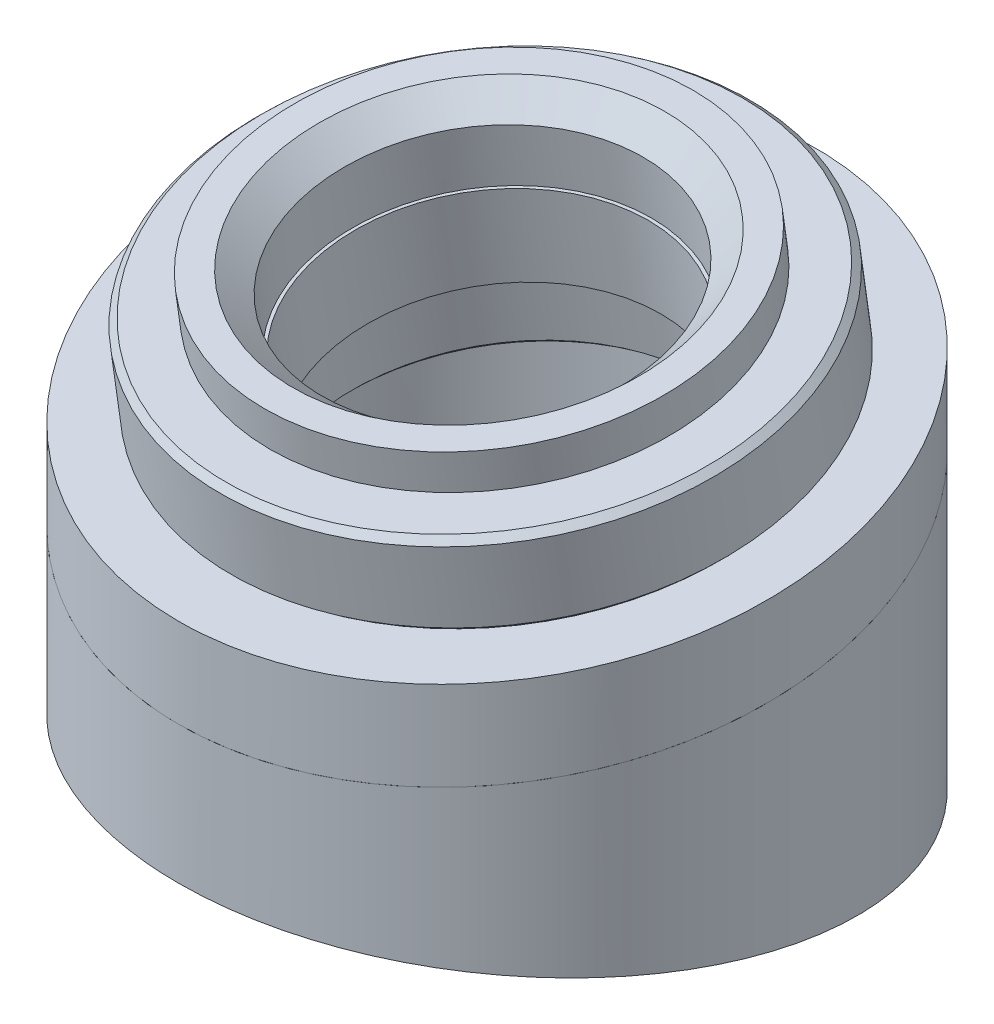
ISO-10303-21;
HEADER;
FILE_DESCRIPTION(('STEP AP214'),'2;1');
FILE_NAME('part.step','',(''),(''),'','','');
FILE_SCHEMA(('AUTOMOTIVE_DESIGN { 1 0 10303 214 1 1 1 1 }'));
ENDSEC;
DATA;
#1=APPLICATION_CONTEXT('core data for automotive mechanical design processes');
#2=APPLICATION_PROTOCOL_DEFINITION('international standard','automotive_design',2000,#1);
#3=PRODUCT_CONTEXT('',#1,'mechanical');
#4=PRODUCT('Part','Part','',(#3));
#5=PRODUCT_RELATED_PRODUCT_CATEGORY('part','',(#4));
#6=PRODUCT_DEFINITION_FORMATION('','',#4);
#7=PRODUCT_DEFINITION_CONTEXT('part definition',#1,'design');
#8=PRODUCT_DEFINITION('design','',#6,#7);
#9=PRODUCT_DEFINITION_SHAPE('','',#8);
#10=(LENGTH_UNIT() NAMED_UNIT(*) SI_UNIT(.MILLI.,.METRE.));
#11=(NAMED_UNIT(*) PLANE_ANGLE_UNIT() SI_UNIT($,.RADIAN.));
#12=(NAMED_UNIT(*) SI_UNIT($,.STERADIAN.) SOLID_ANGLE_UNIT());
#13=UNCERTAINTY_MEASURE_WITH_UNIT(LENGTH_MEASURE(1.E-05),#10,'distance_accuracy_value','');
#14=(GEOMETRIC_REPRESENTATION_CONTEXT(3) GLOBAL_UNCERTAINTY_ASSIGNED_CONTEXT((#13)) GLOBAL_UNIT_ASSIGNED_CONTEXT((#10,
#11,#12)) REPRESENTATION_CONTEXT('',''));
#15=CARTESIAN_POINT('',(0.,0.,0.));
#16=DIRECTION('',(0.,0.,1.));
#17=DIRECTION('',(1.,0.,0.));
#18=AXIS2_PLACEMENT_3D('',#15,#16,#17);
#19=CARTESIAN_POINT('',(4.08249158249159,-2.93246732801997,49.5120390170013));
#20=DIRECTION('',(0.,0.989821487042019,0.142314524170676));
#21=DIRECTION('',(-0.00188004141885013,-0.142314272661145,0.989819737750866));
#22=AXIS2_PLACEMENT_3D('',#19,#20,#21);
#23=PLANE('',#22);
#24=CARTESIAN_POINT('',(4.08249158249159,-2.93246732801997,49.5120390170013));
#25=DIRECTION('',(0.,0.989821487042019,0.142314524170676));
#26=DIRECTION('',(-0.00188004141885013,-0.142314272661145,0.989819737750866));
#27=AXIS2_PLACEMENT_3D('',#24,#25,#26);
#28=CIRCLE('',#27,15.5);
#29=CARTESIAN_POINT('',(4.05335094049941,-5.13833855426771,64.8542449521397));
#30=VERTEX_POINT('',#29);
#31=EDGE_CURVE('P0_E32',#30,#30,#28,.F.);
#32=ORIENTED_EDGE('',*,*,#31,.T.);
#33=EDGE_LOOP('',(#32));
#34=FACE_BOUND('',#33,.T.);
#35=CARTESIAN_POINT('',(4.08249158249159,-2.93246732801997,49.5120390170013));
#36=DIRECTION('',(0.,0.989821487042019,0.142314524170676));
#37=DIRECTION('',(-0.00188004141885013,-0.142314272661145,0.989819737750866));
#38=AXIS2_PLACEMENT_3D('',#35,#36,#37);
#39=CIRCLE('',#38,20.5);
#40=CARTESIAN_POINT('',(4.04395073340516,-5.84990991757343,69.8033436408941));
#41=VERTEX_POINT('',#40);
#42=EDGE_CURVE('P0_E37',#41,#41,#39,.T.);
#43=ORIENTED_EDGE('',*,*,#42,.T.);
#44=EDGE_LOOP('',(#43));
#45=FACE_BOUND('',#44,.T.);
#46=ADVANCED_FACE('P0_F16',(#34,#45),#23,.T.);
#47=CARTESIAN_POINT('',(4.08249158249159,-9.8612177373141,48.5158373478066));
#48=DIRECTION('',(0.,0.989821487042019,0.142314524170676));
#49=DIRECTION('',(-0.00188004141885013,-0.142314272661145,0.989819737750866));
#50=AXIS2_PLACEMENT_3D('',#47,#48,#49);
#51=PLANE('',#50);
#52=CARTESIAN_POINT('',(4.08249158249159,-9.8612177373141,48.5158373478066));
#53=DIRECTION('',(0.,0.989821487042019,0.142314524170676));
#54=DIRECTION('',(-0.00188004141885013,-0.142314272661145,0.989819737750866));
#55=AXIS2_PLACEMENT_3D('',#52,#53,#54);
#56=CIRCLE('',#55,15.5);
#57=CARTESIAN_POINT('',(4.05335094049941,-12.0670889635618,63.858043282945));
#58=VERTEX_POINT('',#57);
#59=EDGE_CURVE('P0_E49',#58,#58,#56,.T.);
#60=ORIENTED_EDGE('',*,*,#59,.T.);
#61=EDGE_LOOP('',(#60));
#62=FACE_BOUND('',#61,.T.);
#63=CARTESIAN_POINT('',(4.08249158249159,-9.8612177373141,48.5158373478066));
#64=DIRECTION('',(0.,0.989821487042019,0.142314524170676));
#65=DIRECTION('',(-0.00188004141885013,-0.142314272661145,0.989819737750866));
#66=AXIS2_PLACEMENT_3D('',#63,#64,#65);
#67=CIRCLE('',#66,20.5);
#68=CARTESIAN_POINT('',(4.04395073340516,-12.7786603268676,68.8071419716993));
#69=VERTEX_POINT('',#68);
#70=EDGE_CURVE('P0_E55',#69,#69,#67,.F.);
#71=ORIENTED_EDGE('',*,*,#70,.T.);
#72=EDGE_LOOP('',(#71));
#73=FACE_BOUND('',#72,.T.);
#74=ADVANCED_FACE('P0_F74',(#62,#73),#51,.F.);
#75=CARTESIAN_POINT('',(4.08249158249159,-2.93246732801997,49.5120390170013));
#76=DIRECTION('',(0.,-0.989821487042019,-0.142314524170676));
#77=DIRECTION('',(0.00188004141885013,0.142314272661145,-0.989819737750866));
#78=AXIS2_PLACEMENT_3D('',#75,#76,#77);
#79=CYLINDRICAL_SURFACE('',#78,21.);
#80=CARTESIAN_POINT('',(4.08249158249159,-9.36630699379309,48.5869946098919));
#81=DIRECTION('',(0.,0.989821487042019,0.142314524170676));
#82=DIRECTION('',(-0.00188004141885013,-0.142314272661145,0.989819737750866));
#83=AXIS2_PLACEMENT_3D('',#80,#81,#82);
#84=CIRCLE('',#83,21.);
#85=CARTESIAN_POINT('',(4.04301071269574,-12.3549067196771,69.3732091026601));
#86=VERTEX_POINT('',#85);
#87=EDGE_CURVE('P0_E11',#86,#86,#84,.T.);
#88=ORIENTED_EDGE('',*,*,#87,.T.);
#89=EDGE_LOOP('',(#88));
#90=FACE_BOUND('',#89,.T.);
#91=CARTESIAN_POINT('',(4.08249158249159,-3.42737807154099,49.4408817549159));
#92=DIRECTION('',(0.,0.989821487042019,0.142314524170676));
#93=DIRECTION('',(-0.00188004141885013,-0.142314272661145,0.989819737750866));
#94=AXIS2_PLACEMENT_3D('',#91,#92,#93);
#95=CIRCLE('',#94,21.);
#96=CARTESIAN_POINT('',(4.04301071269574,-6.41597779742503,70.2270962476841));
#97=VERTEX_POINT('',#96);
#98=EDGE_CURVE('P0_E26',#97,#97,#95,.F.);
#99=ORIENTED_EDGE('',*,*,#98,.T.);
#100=EDGE_LOOP('',(#99));
#101=FACE_BOUND('',#100,.T.);
#102=ADVANCED_FACE('P0_F77',(#90,#101),#79,.T.);
#103=CARTESIAN_POINT('',(4.08249158249159,-2.93246732801997,49.5120390170013));
#104=DIRECTION('',(0.,-0.989821487042019,-0.142314524170676));
#105=DIRECTION('',(0.00188004141885013,0.142314272661145,-0.989819737750866));
#106=AXIS2_PLACEMENT_3D('',#103,#104,#105);
#107=CYLINDRICAL_SURFACE('',#106,15.);
#108=CARTESIAN_POINT('',(4.08249158249159,-9.3663069937931,48.5869946098919));
#109=DIRECTION('',(0.,0.989821487042019,0.142314524170676));
#110=DIRECTION('',(-0.00188004141885013,-0.142314272661145,0.989819737750866));
#111=AXIS2_PLACEMENT_3D('',#108,#109,#110);
#112=CIRCLE('',#111,15.);
#113=CARTESIAN_POINT('',(4.05429096120884,-11.5010210837103,63.4342906761549));
#114=VERTEX_POINT('',#113);
#115=EDGE_CURVE('P0_E44',#114,#114,#112,.F.);
#116=ORIENTED_EDGE('',*,*,#115,.T.);
#117=EDGE_LOOP('',(#116));
#118=FACE_BOUND('',#117,.T.);
#119=CARTESIAN_POINT('',(4.08249158249159,-3.42737807154098,49.440881754916));
#120=DIRECTION('',(0.,0.989821487042019,0.142314524170676));
#121=DIRECTION('',(-0.00188004141885013,-0.142314272661145,0.989819737750866));
#122=AXIS2_PLACEMENT_3D('',#119,#120,#121);
#123=CIRCLE('',#122,15.);
#124=CARTESIAN_POINT('',(4.05429096120884,-5.56209216145815,64.2881778211789));
#125=VERTEX_POINT('',#124);
#126=EDGE_CURVE('P0_E54',#125,#125,#123,.T.);
#127=ORIENTED_EDGE('',*,*,#126,.T.);
#128=EDGE_LOOP('',(#127));
#129=FACE_BOUND('',#128,.T.);
#130=ADVANCED_FACE('P0_F65',(#118,#129),#107,.F.);
#131=CARTESIAN_POINT('',(4.08249158249159,-9.8612177373141,48.5158373478066));
#132=DIRECTION('',(0.,-0.989821487042019,-0.142314524170676));
#133=DIRECTION('',(0.00188004141885013,0.142314272661145,-0.989819737750866));
#134=AXIS2_PLACEMENT_3D('',#131,#132,#133);
#135=CONICAL_SURFACE('',#134,15.5,0.785398163397447);
#136=ORIENTED_EDGE('',*,*,#115,.F.);
#137=EDGE_LOOP('',(#136));
#138=FACE_BOUND('',#137,.T.);
#139=ORIENTED_EDGE('',*,*,#59,.F.);
#140=EDGE_LOOP('',(#139));
#141=FACE_BOUND('',#140,.T.);
#142=ADVANCED_FACE('P0_F67',(#138,#141),#135,.F.);
#143=CARTESIAN_POINT('',(4.08249158249159,-3.42737807154098,49.440881754916));
#144=DIRECTION('',(0.,0.989821487042019,0.142314524170676));
#145=DIRECTION('',(-0.00188004141885013,-0.142314272661145,0.989819737750866));
#146=AXIS2_PLACEMENT_3D('',#143,#144,#145);
#147=CONICAL_SURFACE('',#146,15.,0.785398163397452);
#148=ORIENTED_EDGE('',*,*,#31,.F.);
#149=EDGE_LOOP('',(#148));
#150=FACE_BOUND('',#149,.T.);
#151=ORIENTED_EDGE('',*,*,#126,.F.);
#152=EDGE_LOOP('',(#151));
#153=FACE_BOUND('',#152,.T.);
#154=ADVANCED_FACE('P0_F70',(#150,#153),#147,.F.);
#155=CARTESIAN_POINT('',(4.08249158249159,-9.36630699379309,48.5869946098919));
#156=DIRECTION('',(0.,0.989821487042019,0.142314524170676));
#157=DIRECTION('',(-0.00188004141885013,-0.142314272661145,0.989819737750866));
#158=AXIS2_PLACEMENT_3D('',#155,#156,#157);
#159=CONICAL_SURFACE('',#158,21.,0.785398163397448);
#160=ORIENTED_EDGE('',*,*,#70,.F.);
#161=EDGE_LOOP('',(#160));
#162=FACE_BOUND('',#161,.T.);
#163=ORIENTED_EDGE('',*,*,#87,.F.);
#164=EDGE_LOOP('',(#163));
#165=FACE_BOUND('',#164,.T.);
#166=ADVANCED_FACE('P0_F85',(#162,#165),#159,.T.);
#167=CARTESIAN_POINT('',(4.08249158249159,-2.93246732801997,49.5120390170013));
#168=DIRECTION('',(0.,-0.989821487042019,-0.142314524170676));
#169=DIRECTION('',(0.00188004141885013,0.142314272661145,-0.989819737750866));
#170=AXIS2_PLACEMENT_3D('',#167,#168,#169);
#171=CONICAL_SURFACE('',#170,20.5,0.785398163397441);
#172=ORIENTED_EDGE('',*,*,#98,.F.);
#173=EDGE_LOOP('',(#172));
#174=FACE_BOUND('',#173,.T.);
#175=ORIENTED_EDGE('',*,*,#42,.F.);
#176=EDGE_LOOP('',(#175));
#177=FACE_BOUND('',#176,.T.);
#178=ADVANCED_FACE('P0_F19',(#174,#177),#171,.T.);
#179=CLOSED_SHELL('',(#46,#74,#102,#130,#142,#154,#166,#178));
#180=MANIFOLD_SOLID_BREP('P0_B1',#179);
#181=CARTESIAN_POINT('',(4.0824915824906,-17.6104066475438,49.0075580002511));
#182=DIRECTION('',(0.,0.98982148704202,-0.142314524170668));
#183=DIRECTION('',(-0.603571987724496,0.11346858081768,0.789193092216045));
#184=AXIS2_PLACEMENT_3D('',#181,#182,#183);
#185=PLANE('',#184);
#186=CARTESIAN_POINT('',(4.0824915824906,-17.6104066475438,49.0075580002511));
#187=DIRECTION('',(0.,0.98982148704202,-0.142314524170668));
#188=DIRECTION('',(-0.603571987724496,0.11346858081768,0.789193092216045));
#189=AXIS2_PLACEMENT_3D('',#186,#187,#188);
#190=CIRCLE('',#189,15.5);
#191=CARTESIAN_POINT('',(-5.27287422723908,-15.8516436448697,61.2400509295998));
#192=VERTEX_POINT('',#191);
#193=EDGE_CURVE('P1_E33',#192,#192,#190,.F.);
#194=ORIENTED_EDGE('',*,*,#193,.T.);
#195=EDGE_LOOP('',(#194));
#196=FACE_BOUND('',#195,.T.);
#197=CARTESIAN_POINT('',(4.0824915824906,-17.6104066475438,49.0075580002511));
#198=DIRECTION('',(0.,0.98982148704202,-0.142314524170668));
#199=DIRECTION('',(-0.603571987724496,0.11346858081768,0.789193092216045));
#200=AXIS2_PLACEMENT_3D('',#197,#198,#199);
#201=CIRCLE('',#200,20.5);
#202=CARTESIAN_POINT('',(-8.29073416586156,-15.2843007407813,65.1860163906801));
#203=VERTEX_POINT('',#202);
#204=EDGE_CURVE('P1_E38',#203,#203,#201,.T.);
#205=ORIENTED_EDGE('',*,*,#204,.T.);
#206=EDGE_LOOP('',(#205));
#207=FACE_BOUND('',#206,.T.);
#208=ADVANCED_FACE('P1_F17',(#196,#207),#185,.T.);
#209=CARTESIAN_POINT('',(4.08249158249061,-24.5391570568379,50.0037596694458));
#210=DIRECTION('',(0.,0.98982148704202,-0.142314524170668));
#211=DIRECTION('',(-0.603571987724496,0.11346858081768,0.789193092216045));
#212=AXIS2_PLACEMENT_3D('',#209,#210,#211);
#213=PLANE('',#212);
#214=CARTESIAN_POINT('',(4.08249158249061,-24.5391570568379,50.0037596694458));
#215=DIRECTION('',(0.,0.98982148704202,-0.142314524170668));
#216=DIRECTION('',(-0.603571987724496,0.11346858081768,0.789193092216045));
#217=AXIS2_PLACEMENT_3D('',#214,#215,#216);
#218=CIRCLE('',#217,15.5);
#219=CARTESIAN_POINT('',(-5.27287422723907,-22.7803940541639,62.2362525987945));
#220=VERTEX_POINT('',#219);
#221=EDGE_CURVE('P1_E54',#220,#220,#218,.T.);
#222=ORIENTED_EDGE('',*,*,#221,.T.);
#223=EDGE_LOOP('',(#222));
#224=FACE_BOUND('',#223,.T.);
#225=CARTESIAN_POINT('',(4.08249158249061,-24.5391570568379,50.0037596694458));
#226=DIRECTION('',(0.,0.98982148704202,-0.142314524170668));
#227=DIRECTION('',(-0.603571987724496,0.11346858081768,0.789193092216045));
#228=AXIS2_PLACEMENT_3D('',#225,#226,#227);
#229=CIRCLE('',#228,20.5);
#230=CARTESIAN_POINT('',(-8.29073416586155,-22.2130511500755,66.1822180598747));
#231=VERTEX_POINT('',#230);
#232=EDGE_CURVE('P1_E59',#231,#231,#229,.F.);
#233=ORIENTED_EDGE('',*,*,#232,.T.);
#234=EDGE_LOOP('',(#233));
#235=FACE_BOUND('',#234,.T.);
#236=ADVANCED_FACE('P1_F64',(#224,#235),#213,.F.);
#237=CARTESIAN_POINT('',(4.0824915824906,-17.6104066475438,49.0075580002511));
#238=DIRECTION('',(0.,-0.98982148704202,0.142314524170668));
#239=DIRECTION('',(0.603571987724496,-0.11346858081768,-0.789193092216045));
#240=AXIS2_PLACEMENT_3D('',#237,#238,#239);
#241=CYLINDRICAL_SURFACE('',#240,21.);
#242=CARTESIAN_POINT('',(4.08249158249061,-24.0442463133169,49.9326024073605));
#243=DIRECTION('',(0.,0.98982148704202,-0.142314524170668));
#244=DIRECTION('',(-0.603571987724496,0.11346858081768,0.789193092216045));
#245=AXIS2_PLACEMENT_3D('',#242,#243,#244);
#246=CIRCLE('',#245,21.);
#247=CARTESIAN_POINT('',(-8.5925201597238,-21.6614061161456,66.5056573438974));
#248=VERTEX_POINT('',#247);
#249=EDGE_CURVE('P1_E11',#248,#248,#246,.T.);
#250=ORIENTED_EDGE('',*,*,#249,.T.);
#251=EDGE_LOOP('',(#250));
#252=FACE_BOUND('',#251,.T.);
#253=CARTESIAN_POINT('',(4.08249158249061,-18.1053173910648,49.0787152623365));
#254=DIRECTION('',(0.,0.98982148704202,-0.142314524170668));
#255=DIRECTION('',(-0.603571987724496,0.11346858081768,0.789193092216045));
#256=AXIS2_PLACEMENT_3D('',#253,#254,#255);
#257=CIRCLE('',#256,21.);
#258=CARTESIAN_POINT('',(-8.59252015972381,-15.7224771938935,65.6517701988734));
#259=VERTEX_POINT('',#258);
#260=EDGE_CURVE('P1_E27',#259,#259,#257,.F.);
#261=ORIENTED_EDGE('',*,*,#260,.T.);
#262=EDGE_LOOP('',(#261));
#263=FACE_BOUND('',#262,.T.);
#264=ADVANCED_FACE('P1_F84',(#252,#263),#241,.T.);
#265=CARTESIAN_POINT('',(4.0824915824906,-17.6104066475438,49.0075580002511));
#266=DIRECTION('',(0.,-0.98982148704202,0.142314524170668));
#267=DIRECTION('',(0.603571987724496,-0.11346858081768,-0.789193092216045));
#268=AXIS2_PLACEMENT_3D('',#265,#266,#267);
#269=CYLINDRICAL_SURFACE('',#268,15.);
#270=CARTESIAN_POINT('',(4.08249158249061,-24.0442463133169,49.9326024073605));
#271=DIRECTION('',(0.,0.98982148704202,-0.142314524170668));
#272=DIRECTION('',(-0.603571987724496,0.11346858081768,0.789193092216045));
#273=AXIS2_PLACEMENT_3D('',#270,#271,#272);
#274=CIRCLE('',#273,15.);
#275=CARTESIAN_POINT('',(-4.97108823337682,-22.3422176010517,61.7704987906012));
#276=VERTEX_POINT('',#275);
#277=EDGE_CURVE('P1_E45',#276,#276,#274,.F.);
#278=ORIENTED_EDGE('',*,*,#277,.T.);
#279=EDGE_LOOP('',(#278));
#280=FACE_BOUND('',#279,.T.);
#281=CARTESIAN_POINT('',(4.08249158249061,-18.1053173910648,49.0787152623365));
#282=DIRECTION('',(0.,0.98982148704202,-0.142314524170668));
#283=DIRECTION('',(-0.603571987724496,0.11346858081768,0.789193092216045));
#284=AXIS2_PLACEMENT_3D('',#281,#282,#283);
#285=CIRCLE('',#284,15.);
#286=CARTESIAN_POINT('',(-4.97108823337683,-16.4032886787996,60.9166116455771));
#287=VERTEX_POINT('',#286);
#288=EDGE_CURVE('P1_E50',#287,#287,#285,.T.);
#289=ORIENTED_EDGE('',*,*,#288,.T.);
#290=EDGE_LOOP('',(#289));
#291=FACE_BOUND('',#290,.T.);
#292=ADVANCED_FACE('P1_F89',(#280,#291),#269,.F.);
#293=CARTESIAN_POINT('',(4.08249158249061,-24.5391570568379,50.0037596694458));
#294=DIRECTION('',(0.,-0.98982148704202,0.142314524170668));
#295=DIRECTION('',(0.603571987724496,-0.11346858081768,-0.789193092216045));
#296=AXIS2_PLACEMENT_3D('',#293,#294,#295);
#297=CONICAL_SURFACE('',#296,15.5,0.785398163397447);
#298=ORIENTED_EDGE('',*,*,#277,.F.);
#299=EDGE_LOOP('',(#298));
#300=FACE_BOUND('',#299,.T.);
#301=ORIENTED_EDGE('',*,*,#221,.F.);
#302=EDGE_LOOP('',(#301));
#303=FACE_BOUND('',#302,.T.);
#304=ADVANCED_FACE('P1_F75',(#300,#303),#297,.F.);
#305=CARTESIAN_POINT('',(4.08249158249061,-18.1053173910648,49.0787152623365));
#306=DIRECTION('',(0.,0.98982148704202,-0.142314524170668));
#307=DIRECTION('',(-0.603571987724496,0.11346858081768,0.789193092216045));
#308=AXIS2_PLACEMENT_3D('',#305,#306,#307);
#309=CONICAL_SURFACE('',#308,15.,0.785398163397452);
#310=ORIENTED_EDGE('',*,*,#193,.F.);
#311=EDGE_LOOP('',(#310));
#312=FACE_BOUND('',#311,.T.);
#313=ORIENTED_EDGE('',*,*,#288,.F.);
#314=EDGE_LOOP('',(#313));
#315=FACE_BOUND('',#314,.T.);
#316=ADVANCED_FACE('P1_F69',(#312,#315),#309,.F.);
#317=CARTESIAN_POINT('',(4.08249158249061,-24.0442463133169,49.9326024073605));
#318=DIRECTION('',(0.,0.98982148704202,-0.142314524170668));
#319=DIRECTION('',(-0.603571987724496,0.11346858081768,0.789193092216045));
#320=AXIS2_PLACEMENT_3D('',#317,#318,#319);
#321=CONICAL_SURFACE('',#320,21.,0.785398163397448);
#322=ORIENTED_EDGE('',*,*,#232,.F.);
#323=EDGE_LOOP('',(#322));
#324=FACE_BOUND('',#323,.T.);
#325=ORIENTED_EDGE('',*,*,#249,.F.);
#326=EDGE_LOOP('',(#325));
#327=FACE_BOUND('',#326,.T.);
#328=ADVANCED_FACE('P1_F66',(#324,#327),#321,.T.);
#329=CARTESIAN_POINT('',(4.0824915824906,-17.6104066475438,49.0075580002511));
#330=DIRECTION('',(0.,-0.98982148704202,0.142314524170668));
#331=DIRECTION('',(0.603571987724496,-0.11346858081768,-0.789193092216045));
#332=AXIS2_PLACEMENT_3D('',#329,#330,#331);
#333=CONICAL_SURFACE('',#332,20.5,0.785398163397441);
#334=ORIENTED_EDGE('',*,*,#260,.F.);
#335=EDGE_LOOP('',(#334));
#336=FACE_BOUND('',#335,.T.);
#337=ORIENTED_EDGE('',*,*,#204,.F.);
#338=EDGE_LOOP('',(#337));
#339=FACE_BOUND('',#338,.T.);
#340=ADVANCED_FACE('P1_F20',(#336,#339),#333,.T.);
#341=CLOSED_SHELL('',(#208,#236,#264,#292,#304,#316,#328,#340));
#342=MANIFOLD_SOLID_BREP('P1_B1',#341);
#343=CARTESIAN_POINT('',(4.08249158249158,7.39013391009765,50.9962016691947));
#344=DIRECTION('',(0.,0.989821487042019,0.142314524170676));
#345=DIRECTION('',(-0.623827924002348,-0.111227584206739,0.773606583313801));
#346=AXIS2_PLACEMENT_3D('',#343,#344,#345);
#347=PLANE('',#346);
#348=CARTESIAN_POINT('',(4.08249158249158,7.39013391009765,50.9962016691947));
#349=DIRECTION('',(0.,0.989821487042019,0.142314524170676));
#350=DIRECTION('',(-0.623827924002348,-0.111227584206739,0.773606583313801));
#351=AXIS2_PLACEMENT_3D('',#348,#349,#350);
#352=CIRCLE('',#351,15.5);
#353=CARTESIAN_POINT('',(-5.58684123954483,5.66610635489319,62.9871037105587));
#354=VERTEX_POINT('',#353);
#355=EDGE_CURVE('P2_E33',#354,#354,#352,.F.);
#356=ORIENTED_EDGE('',*,*,#355,.T.);
#357=EDGE_LOOP('',(#356));
#358=FACE_BOUND('',#357,.T.);
#359=CARTESIAN_POINT('',(4.08249158249158,7.39013391009765,50.9962016691947));
#360=DIRECTION('',(0.,0.989821487042019,0.142314524170676));
#361=DIRECTION('',(-0.623827924002348,-0.111227584206739,0.773606583313801));
#362=AXIS2_PLACEMENT_3D('',#359,#360,#361);
#363=CIRCLE('',#362,20.5);
#364=CARTESIAN_POINT('',(-8.70598085955656,5.1099684338595,66.8551366271277));
#365=VERTEX_POINT('',#364);
#366=EDGE_CURVE('P2_E38',#365,#365,#363,.T.);
#367=ORIENTED_EDGE('',*,*,#366,.T.);
#368=EDGE_LOOP('',(#367));
#369=FACE_BOUND('',#368,.T.);
#370=ADVANCED_FACE('P2_F17',(#358,#369),#347,.T.);
#371=CARTESIAN_POINT('',(4.08249158249158,0.461383500803518,50.));
#372=DIRECTION('',(0.,0.989821487042019,0.142314524170676));
#373=DIRECTION('',(-0.623827924002348,-0.111227584206739,0.773606583313801));
#374=AXIS2_PLACEMENT_3D('',#371,#372,#373);
#375=PLANE('',#374);
#376=CARTESIAN_POINT('',(4.08249158249158,0.461383500803518,50.));
#377=DIRECTION('',(0.,0.989821487042019,0.142314524170676));
#378=DIRECTION('',(-0.623827924002348,-0.111227584206739,0.773606583313801));
#379=AXIS2_PLACEMENT_3D('',#376,#377,#378);
#380=CIRCLE('',#379,15.5);
#381=CARTESIAN_POINT('',(-5.58684123954482,-1.26264405440094,61.9909020413639));
#382=VERTEX_POINT('',#381);
#383=EDGE_CURVE('P2_E50',#382,#382,#380,.T.);
#384=ORIENTED_EDGE('',*,*,#383,.T.);
#385=EDGE_LOOP('',(#384));
#386=FACE_BOUND('',#385,.T.);
#387=CARTESIAN_POINT('',(4.08249158249158,0.461383500803518,50.));
#388=DIRECTION('',(0.,0.989821487042019,0.142314524170676));
#389=DIRECTION('',(-0.623827924002348,-0.111227584206739,0.773606583313801));
#390=AXIS2_PLACEMENT_3D('',#387,#388,#389);
#391=CIRCLE('',#390,20.5);
#392=CARTESIAN_POINT('',(-8.70598085955657,-1.81878197543464,65.8589349579329));
#393=VERTEX_POINT('',#392);
#394=EDGE_CURVE('P2_E56',#393,#393,#391,.F.);
#395=ORIENTED_EDGE('',*,*,#394,.T.);
#396=EDGE_LOOP('',(#395));
#397=FACE_BOUND('',#396,.T.);
#398=ADVANCED_FACE('P2_F75',(#386,#397),#375,.F.);
#399=CARTESIAN_POINT('',(4.08249158249158,7.39013391009765,50.9962016691947));
#400=DIRECTION('',(0.,-0.989821487042019,-0.142314524170676));
#401=DIRECTION('',(0.623827924002348,0.111227584206739,-0.773606583313801));
#402=AXIS2_PLACEMENT_3D('',#399,#400,#401);
#403=CYLINDRICAL_SURFACE('',#402,21.);
#404=CARTESIAN_POINT('',(4.08249158249158,0.956294244324528,50.0711572620853));
#405=DIRECTION('',(0.,0.989821487042019,0.142314524170676));
#406=DIRECTION('',(-0.623827924002348,-0.111227584206739,0.773606583313801));
#407=AXIS2_PLACEMENT_3D('',#404,#405,#406);
#408=CIRCLE('',#407,21.);
#409=CARTESIAN_POINT('',(-9.01789482155774,-1.37948502401699,66.3168955116752));
#410=VERTEX_POINT('',#409);
#411=EDGE_CURVE('P2_E11',#410,#410,#408,.T.);
#412=ORIENTED_EDGE('',*,*,#411,.T.);
#413=EDGE_LOOP('',(#412));
#414=FACE_BOUND('',#413,.T.);
#415=CARTESIAN_POINT('',(4.08249158249158,6.89522316657663,50.9250444071094));
#416=DIRECTION('',(0.,0.989821487042019,0.142314524170676));
#417=DIRECTION('',(-0.623827924002348,-0.111227584206739,0.773606583313801));
#418=AXIS2_PLACEMENT_3D('',#415,#416,#417);
#419=CIRCLE('',#418,21.);
#420=CARTESIAN_POINT('',(-9.01789482155774,4.55944389823511,67.1707826566992));
#421=VERTEX_POINT('',#420);
#422=EDGE_CURVE('P2_E27',#421,#421,#419,.F.);
#423=ORIENTED_EDGE('',*,*,#422,.T.);
#424=EDGE_LOOP('',(#423));
#425=FACE_BOUND('',#424,.T.);
#426=ADVANCED_FACE('P2_F78',(#414,#425),#403,.T.);
#427=CARTESIAN_POINT('',(4.08249158249158,7.39013391009765,50.9962016691947));
#428=DIRECTION('',(0.,-0.989821487042019,-0.142314524170676));
#429=DIRECTION('',(0.623827924002348,0.111227584206739,-0.773606583313801));
#430=AXIS2_PLACEMENT_3D('',#427,#428,#429);
#431=CYLINDRICAL_SURFACE('',#430,15.);
#432=CARTESIAN_POINT('',(4.08249158249158,0.956294244324524,50.0711572620853));
#433=DIRECTION('',(0.,0.989821487042019,0.142314524170676));
#434=DIRECTION('',(-0.623827924002348,-0.111227584206739,0.773606583313801));
#435=AXIS2_PLACEMENT_3D('',#432,#433,#434);
#436=CIRCLE('',#435,15.);
#437=CARTESIAN_POINT('',(-5.27492727754365,-0.712119518776563,61.6752560117924));
#438=VERTEX_POINT('',#437);
#439=EDGE_CURVE('P2_E45',#438,#438,#436,.F.);
#440=ORIENTED_EDGE('',*,*,#439,.T.);
#441=EDGE_LOOP('',(#440));
#442=FACE_BOUND('',#441,.T.);
#443=CARTESIAN_POINT('',(4.08249158249158,6.89522316657664,50.9250444071094));
#444=DIRECTION('',(0.,0.989821487042019,0.142314524170676));
#445=DIRECTION('',(-0.623827924002348,-0.111227584206739,0.773606583313801));
#446=AXIS2_PLACEMENT_3D('',#443,#444,#445);
#447=CIRCLE('',#446,15.);
#448=CARTESIAN_POINT('',(-5.27492727754365,5.22680940347555,62.5291431568164));
#449=VERTEX_POINT('',#448);
#450=EDGE_CURVE('P2_E55',#449,#449,#447,.T.);
#451=ORIENTED_EDGE('',*,*,#450,.T.);
#452=EDGE_LOOP('',(#451));
#453=FACE_BOUND('',#452,.T.);
#454=ADVANCED_FACE('P2_F66',(#442,#453),#431,.F.);
#455=CARTESIAN_POINT('',(4.08249158249158,0.461383500803518,50.));
#456=DIRECTION('',(0.,-0.989821487042019,-0.142314524170676));
#457=DIRECTION('',(0.623827924002348,0.111227584206739,-0.773606583313801));
#458=AXIS2_PLACEMENT_3D('',#455,#456,#457);
#459=CONICAL_SURFACE('',#458,15.5,0.785398163397447);
#460=ORIENTED_EDGE('',*,*,#439,.F.);
#461=EDGE_LOOP('',(#460));
#462=FACE_BOUND('',#461,.T.);
#463=ORIENTED_EDGE('',*,*,#383,.F.);
#464=EDGE_LOOP('',(#463));
#465=FACE_BOUND('',#464,.T.);
#466=ADVANCED_FACE('P2_F68',(#462,#465),#459,.F.);
#467=CARTESIAN_POINT('',(4.08249158249158,6.89522316657664,50.9250444071094));
#468=DIRECTION('',(0.,0.989821487042019,0.142314524170676));
#469=DIRECTION('',(-0.623827924002348,-0.111227584206739,0.773606583313801));
#470=AXIS2_PLACEMENT_3D('',#467,#468,#469);
#471=CONICAL_SURFACE('',#470,15.,0.785398163397452);
#472=ORIENTED_EDGE('',*,*,#355,.F.);
#473=EDGE_LOOP('',(#472));
#474=FACE_BOUND('',#473,.T.);
#475=ORIENTED_EDGE('',*,*,#450,.F.);
#476=EDGE_LOOP('',(#475));
#477=FACE_BOUND('',#476,.T.);
#478=ADVANCED_FACE('P2_F71',(#474,#477),#471,.F.);
#479=CARTESIAN_POINT('',(4.08249158249158,0.956294244324528,50.0711572620853));
#480=DIRECTION('',(0.,0.989821487042019,0.142314524170676));
#481=DIRECTION('',(-0.623827924002348,-0.111227584206739,0.773606583313801));
#482=AXIS2_PLACEMENT_3D('',#479,#480,#481);
#483=CONICAL_SURFACE('',#482,21.,0.785398163397448);
#484=ORIENTED_EDGE('',*,*,#394,.F.);
#485=EDGE_LOOP('',(#484));
#486=FACE_BOUND('',#485,.T.);
#487=ORIENTED_EDGE('',*,*,#411,.F.);
#488=EDGE_LOOP('',(#487));
#489=FACE_BOUND('',#488,.T.);
#490=ADVANCED_FACE('P2_F86',(#486,#489),#483,.T.);
#491=CARTESIAN_POINT('',(4.08249158249158,7.39013391009765,50.9962016691947));
#492=DIRECTION('',(0.,-0.989821487042019,-0.142314524170676));
#493=DIRECTION('',(0.623827924002348,0.111227584206739,-0.773606583313801));
#494=AXIS2_PLACEMENT_3D('',#491,#492,#493);
#495=CONICAL_SURFACE('',#494,20.5,0.785398163397441);
#496=ORIENTED_EDGE('',*,*,#422,.F.);
#497=EDGE_LOOP('',(#496));
#498=FACE_BOUND('',#497,.T.);
#499=ORIENTED_EDGE('',*,*,#366,.F.);
#500=EDGE_LOOP('',(#499));
#501=FACE_BOUND('',#500,.T.);
#502=ADVANCED_FACE('P2_F20',(#498,#501),#495,.T.);
#503=CLOSED_SHELL('',(#370,#398,#426,#454,#466,#478,#490,#502));
#504=MANIFOLD_SOLID_BREP('P2_B1',#503);
#505=CARTESIAN_POINT('',(4.08249158249158,3.92575870545058,50.4981008345974));
#506=DIRECTION('',(0.,-0.989821487042019,-0.142314524170676));
#507=DIRECTION('',(-1.,0.,0.));
#508=AXIS2_PLACEMENT_3D('',#505,#506,#507);
#509=PLANE('',#508);
#510=CARTESIAN_POINT('',(4.08249158249158,3.92575870545058,50.4981008345974));
#511=DIRECTION('',(0.,-0.989821487042019,-0.142314524170676));
#512=DIRECTION('',(-1.,0.,0.));
#513=AXIS2_PLACEMENT_3D('',#510,#511,#512);
#514=CIRCLE('',#513,15.);
#515=CARTESIAN_POINT('',(-10.9175084175084,3.92575870545058,50.4981008345974));
#516=VERTEX_POINT('',#515);
#517=EDGE_CURVE('P3_E33',#516,#516,#514,.T.);
#518=ORIENTED_EDGE('',*,*,#517,.T.);
#519=EDGE_LOOP('',(#518));
#520=FACE_BOUND('',#519,.T.);
#521=CARTESIAN_POINT('',(4.08249158249158,3.92575870545058,50.4981008345974));
#522=DIRECTION('',(0.,-0.989821487042019,-0.142314524170676));
#523=DIRECTION('',(-1.,0.,0.));
#524=AXIS2_PLACEMENT_3D('',#521,#522,#523);
#525=CIRCLE('',#524,12.75);
#526=CARTESIAN_POINT('',(-8.66750841750841,3.92575870545058,50.4981008345974));
#527=VERTEX_POINT('',#526);
#528=EDGE_CURVE('P3_E38',#527,#527,#525,.T.);
#529=ORIENTED_EDGE('',*,*,#528,.F.);
#530=EDGE_LOOP('',(#529));
#531=FACE_BOUND('',#530,.T.);
#532=ADVANCED_FACE('P3_F18',(#520,#531),#509,.T.);
#533=CARTESIAN_POINT('',(4.08249158249158,3.92575870545058,50.4981008345974));
#534=DIRECTION('',(0.,0.989821487042019,0.142314524170676));
#535=DIRECTION('',(1.,0.,0.));
#536=AXIS2_PLACEMENT_3D('',#533,#534,#535);
#537=CYLINDRICAL_SURFACE('',#536,15.);
#538=ORIENTED_EDGE('',*,*,#517,.F.);
#539=EDGE_LOOP('',(#538));
#540=FACE_BOUND('',#539,.T.);
#541=CARTESIAN_POINT('',(4.08249158249158,7.39013391009765,50.9962016691947));
#542=DIRECTION('',(0.,-0.989821487042019,-0.142314524170676));
#543=DIRECTION('',(-1.,0.,0.));
#544=AXIS2_PLACEMENT_3D('',#541,#542,#543);
#545=CIRCLE('',#544,15.);
#546=CARTESIAN_POINT('',(-10.9175084175084,7.39013391009765,50.9962016691948));
#547=VERTEX_POINT('',#546);
#548=EDGE_CURVE('P3_E41',#547,#547,#545,.T.);
#549=ORIENTED_EDGE('',*,*,#548,.T.);
#550=EDGE_LOOP('',(#549));
#551=FACE_BOUND('',#550,.T.);
#552=ADVANCED_FACE('P3_F68',(#540,#551),#537,.T.);
#553=CARTESIAN_POINT('',(4.08249158249158,3.92575870545058,50.4981008345974));
#554=DIRECTION('',(0.,0.989821487042019,0.142314524170676));
#555=DIRECTION('',(1.,0.,0.));
#556=AXIS2_PLACEMENT_3D('',#553,#554,#555);
#557=CYLINDRICAL_SURFACE('',#556,12.75);
#558=CARTESIAN_POINT('',(4.08249158249158,8.37995539713968,51.1385161933654));
#559=DIRECTION('',(0.,0.989821487042019,0.142314524170676));
#560=DIRECTION('',(1.,0.,0.));
#561=AXIS2_PLACEMENT_3D('',#558,#559,#560);
#562=CIRCLE('',#561,12.75);
#563=CARTESIAN_POINT('',(16.8324915824916,8.37995539713968,51.1385161933654));
#564=VERTEX_POINT('',#563);
#565=EDGE_CURVE('P3_E27',#564,#564,#562,.T.);
#566=ORIENTED_EDGE('',*,*,#565,.T.);
#567=EDGE_LOOP('',(#566));
#568=FACE_BOUND('',#567,.T.);
#569=ORIENTED_EDGE('',*,*,#528,.T.);
#570=EDGE_LOOP('',(#569));
#571=FACE_BOUND('',#570,.T.);
#572=ADVANCED_FACE('P3_F93',(#568,#571),#557,.F.);
#573=CARTESIAN_POINT('',(4.08249158249158,10.3595983712237,51.4231452417068));
#574=DIRECTION('',(0.,0.989821487042019,0.142314524170676));
#575=DIRECTION('',(1.,0.,0.));
#576=AXIS2_PLACEMENT_3D('',#573,#574,#575);
#577=PLANE('',#576);
#578=CARTESIAN_POINT('',(4.08249158249158,10.3595983712237,51.4231452417068));
#579=DIRECTION('',(0.,0.989821487042019,0.142314524170676));
#580=DIRECTION('',(1.,0.,0.));
#581=AXIS2_PLACEMENT_3D('',#578,#579,#580);
#582=CIRCLE('',#581,14.75);
#583=CARTESIAN_POINT('',(18.8324915824916,10.3595983712237,51.4231452417068));
#584=VERTEX_POINT('',#583);
#585=EDGE_CURVE('P3_E11',#584,#584,#582,.F.);
#586=ORIENTED_EDGE('',*,*,#585,.T.);
#587=EDGE_LOOP('',(#586));
#588=FACE_BOUND('',#587,.T.);
#589=CARTESIAN_POINT('',(4.08249158249158,10.3595983712237,51.4231452417068));
#590=DIRECTION('',(0.,0.989821487042019,0.142314524170676));
#591=DIRECTION('',(1.,0.,0.));
#592=AXIS2_PLACEMENT_3D('',#589,#590,#591);
#593=CIRCLE('',#592,17.);
#594=CARTESIAN_POINT('',(21.0824915824916,10.3595983712237,51.4231452417068));
#595=VERTEX_POINT('',#594);
#596=EDGE_CURVE('P3_E58',#595,#595,#593,.T.);
#597=ORIENTED_EDGE('',*,*,#596,.T.);
#598=EDGE_LOOP('',(#597));
#599=FACE_BOUND('',#598,.T.);
#600=ADVANCED_FACE('P3_F74',(#588,#599),#577,.T.);
#601=CARTESIAN_POINT('',(4.08249158249158,7.39013391009765,50.9962016691947));
#602=DIRECTION('',(0.,0.989821487042019,0.142314524170676));
#603=DIRECTION('',(1.,0.,0.));
#604=AXIS2_PLACEMENT_3D('',#601,#602,#603);
#605=PLANE('',#604);
#606=ORIENTED_EDGE('',*,*,#548,.F.);
#607=EDGE_LOOP('',(#606));
#608=FACE_BOUND('',#607,.T.);
#609=CARTESIAN_POINT('',(4.08249158249158,7.39013391009765,50.9962016691947));
#610=DIRECTION('',(0.,0.989821487042019,0.142314524170676));
#611=DIRECTION('',(1.,0.,0.));
#612=AXIS2_PLACEMENT_3D('',#609,#610,#611);
#613=CIRCLE('',#612,17.);
#614=CARTESIAN_POINT('',(21.0824915824916,7.39013391009765,50.9962016691947));
#615=VERTEX_POINT('',#614);
#616=EDGE_CURVE('P3_E53',#615,#615,#613,.T.);
#617=ORIENTED_EDGE('',*,*,#616,.F.);
#618=EDGE_LOOP('',(#617));
#619=FACE_BOUND('',#618,.T.);
#620=ADVANCED_FACE('P3_F70',(#608,#619),#605,.F.);
#621=CARTESIAN_POINT('',(4.08249158249158,10.3595983712237,51.4231452417068));
#622=DIRECTION('',(0.,-0.989821487042019,-0.142314524170676));
#623=DIRECTION('',(-1.,0.,0.));
#624=AXIS2_PLACEMENT_3D('',#621,#622,#623);
#625=CYLINDRICAL_SURFACE('',#624,17.);
#626=ORIENTED_EDGE('',*,*,#596,.F.);
#627=EDGE_LOOP('',(#626));
#628=FACE_BOUND('',#627,.T.);
#629=ORIENTED_EDGE('',*,*,#616,.T.);
#630=EDGE_LOOP('',(#629));
#631=FACE_BOUND('',#630,.T.);
#632=ADVANCED_FACE('P3_F73',(#628,#631),#625,.T.);
#633=CARTESIAN_POINT('',(4.08249158249158,8.37995539713968,51.1385161933654));
#634=DIRECTION('',(0.,0.989821487042019,0.142314524170676));
#635=DIRECTION('',(1.,0.,0.));
#636=AXIS2_PLACEMENT_3D('',#633,#634,#635);
#637=CONICAL_SURFACE('',#636,12.75,0.78539816339745);
#638=ORIENTED_EDGE('',*,*,#585,.F.);
#639=EDGE_LOOP('',(#638));
#640=FACE_BOUND('',#639,.T.);
#641=ORIENTED_EDGE('',*,*,#565,.F.);
#642=EDGE_LOOP('',(#641));
#643=FACE_BOUND('',#642,.T.);
#644=ADVANCED_FACE('P3_F21',(#640,#643),#637,.F.);
#645=CLOSED_SHELL('',(#532,#552,#572,#600,#620,#632,#644));
#646=MANIFOLD_SOLID_BREP('P3_B1',#645);
#647=CARTESIAN_POINT('',(4.08249158249158,19.8669342482426,50.));
#648=DIRECTION('',(0.,-1.,0.));
#649=DIRECTION('',(0.,0.,-1.));
#650=AXIS2_PLACEMENT_3D('',#647,#648,#649);
#651=CYLINDRICAL_SURFACE('',#650,25.);
#652=CARTESIAN_POINT('',(4.08249158249158,0.461383500803516,50.));
#653=DIRECTION('',(0.,-0.989821487042019,-0.142314524170676));
#654=DIRECTION('',(0.,-0.142314524170676,0.989821487042019));
#655=AXIS2_PLACEMENT_3D('',#652,#653,#654);
#656=ELLIPSE('',#655,25.2570795110843,25.);
#657=CARTESIAN_POINT('',(4.08249158249158,-3.13306575175738,75.));
#658=VERTEX_POINT('',#657);
#659=EDGE_CURVE('P4_E25',#658,#658,#656,.T.);
#660=ORIENTED_EDGE('',*,*,#659,.T.);
#661=EDGE_LOOP('',(#660));
#662=FACE_BOUND('',#661,.T.);
#663=CARTESIAN_POINT('',(4.08249158249158,-6.53861649919648,50.));
#664=DIRECTION('',(0.,0.989821487042019,0.142314524170676));
#665=DIRECTION('',(0.,-0.142314524170676,0.989821487042019));
#666=AXIS2_PLACEMENT_3D('',#663,#664,#665);
#667=ELLIPSE('',#666,25.2570795110843,25.);
#668=CARTESIAN_POINT('',(4.08249158249158,-10.1330657517574,75.));
#669=VERTEX_POINT('',#668);
#670=EDGE_CURVE('P4_E32',#669,#669,#667,.T.);
#671=ORIENTED_EDGE('',*,*,#670,.T.);
#672=EDGE_LOOP('',(#671));
#673=FACE_BOUND('',#672,.T.);
#674=ADVANCED_FACE('P4_F16',(#662,#673),#651,.T.);
#675=CARTESIAN_POINT('',(-27.4175084175084,-3.13306575175738,75.));
#676=DIRECTION('',(0.,-0.989821487042019,-0.142314524170676));
#677=DIRECTION('',(0.,0.142314524170676,-0.989821487042019));
#678=AXIS2_PLACEMENT_3D('',#675,#676,#677);
#679=PLANE('',#678);
#680=CARTESIAN_POINT('',(4.08249158249158,0.461383500803519,50.));
#681=DIRECTION('',(0.,0.989821487042019,0.142314524170676));
#682=DIRECTION('',(0.,-0.142314524170676,0.989821487042019));
#683=AXIS2_PLACEMENT_3D('',#680,#681,#682);
#684=CIRCLE('',#683,15.);
#685=CARTESIAN_POINT('',(4.08249158249158,-1.67333436175662,64.8473223056303));
#686=VERTEX_POINT('',#685);
#687=EDGE_CURVE('P4_E11',#686,#686,#684,.T.);
#688=ORIENTED_EDGE('',*,*,#687,.F.);
#689=EDGE_LOOP('',(#688));
#690=FACE_BOUND('',#689,.T.);
#691=ORIENTED_EDGE('',*,*,#659,.F.);
#692=EDGE_LOOP('',(#691));
#693=FACE_BOUND('',#692,.T.);
#694=ADVANCED_FACE('P4_F88',(#690,#693),#679,.F.);
#695=CARTESIAN_POINT('',(-27.4175084175084,-10.1330657517574,75.));
#696=DIRECTION('',(0.,0.989821487042019,0.142314524170676));
#697=DIRECTION('',(0.,-0.142314524170676,0.989821487042019));
#698=AXIS2_PLACEMENT_3D('',#695,#696,#697);
#699=PLANE('',#698);
#700=CARTESIAN_POINT('',(4.08249158249158,-6.396842532667,49.0139381824039));
#701=DIRECTION('',(0.,-0.989821487042019,-0.142314524170676));
#702=DIRECTION('',(0.,0.142314524170676,-0.989821487042019));
#703=AXIS2_PLACEMENT_3D('',#700,#701,#702);
#704=CIRCLE('',#703,21.);
#705=CARTESIAN_POINT('',(4.08249158249158,-3.40823752508281,28.2276869545215));
#706=VERTEX_POINT('',#705);
#707=EDGE_CURVE('P4_E53',#706,#706,#704,.T.);
#708=ORIENTED_EDGE('',*,*,#707,.F.);
#709=EDGE_LOOP('',(#708));
#710=FACE_BOUND('',#709,.T.);
#711=ORIENTED_EDGE('',*,*,#670,.F.);
#712=EDGE_LOOP('',(#711));
#713=FACE_BOUND('',#712,.T.);
#714=ADVANCED_FACE('P4_F86',(#710,#713),#699,.F.);
#715=CARTESIAN_POINT('',(4.08249158249158,3.92575870545059,50.4981008345974));
#716=DIRECTION('',(0.,-0.989821487042019,-0.142314524170676));
#717=DIRECTION('',(0.,0.142314524170676,-0.989821487042019));
#718=AXIS2_PLACEMENT_3D('',#715,#716,#717);
#719=CYLINDRICAL_SURFACE('',#718,15.);
#720=CARTESIAN_POINT('',(4.08249158249158,3.92575870545059,50.4981008345974));
#721=DIRECTION('',(0.,0.989821487042019,0.142314524170676));
#722=DIRECTION('',(0.,-0.142314524170676,0.989821487042019));
#723=AXIS2_PLACEMENT_3D('',#720,#721,#722);
#724=CIRCLE('',#723,15.);
#725=CARTESIAN_POINT('',(4.08249158249158,1.79104084289045,65.3454231402277));
#726=VERTEX_POINT('',#725);
#727=EDGE_CURVE('P4_E36',#726,#726,#724,.T.);
#728=ORIENTED_EDGE('',*,*,#727,.F.);
#729=EDGE_LOOP('',(#728));
#730=FACE_BOUND('',#729,.T.);
#731=ORIENTED_EDGE('',*,*,#687,.T.);
#732=EDGE_LOOP('',(#731));
#733=FACE_BOUND('',#732,.T.);
#734=ADVANCED_FACE('P4_F75',(#730,#733),#719,.T.);
#735=CARTESIAN_POINT('',(4.08249158249158,3.92575870545059,50.4981008345974));
#736=DIRECTION('',(0.,0.989821487042019,0.142314524170676));
#737=DIRECTION('',(0.,-0.142314524170676,0.989821487042019));
#738=AXIS2_PLACEMENT_3D('',#735,#736,#737);
#739=PLANE('',#738);
#740=CARTESIAN_POINT('',(4.08249158249158,3.92575870545059,50.4981008345974));
#741=DIRECTION('',(0.,0.989821487042019,0.142314524170676));
#742=DIRECTION('',(0.,-0.142314524170676,0.989821487042019));
#743=AXIS2_PLACEMENT_3D('',#740,#741,#742);
#744=CIRCLE('',#743,12.5);
#745=CARTESIAN_POINT('',(4.08249158249158,2.14682715331714,62.8708694226226));
#746=VERTEX_POINT('',#745);
#747=EDGE_CURVE('P4_E54',#746,#746,#744,.T.);
#748=ORIENTED_EDGE('',*,*,#747,.F.);
#749=EDGE_LOOP('',(#748));
#750=FACE_BOUND('',#749,.T.);
#751=ORIENTED_EDGE('',*,*,#727,.T.);
#752=EDGE_LOOP('',(#751));
#753=FACE_BOUND('',#752,.T.);
#754=ADVANCED_FACE('P4_F71',(#750,#753),#739,.T.);
#755=CARTESIAN_POINT('',(4.08249158249158,-2.93246732801994,49.5120390170013));
#756=DIRECTION('',(0.,-0.989821487042019,-0.142314524170676));
#757=DIRECTION('',(0.,0.142314524170676,-0.989821487042019));
#758=AXIS2_PLACEMENT_3D('',#755,#756,#757);
#759=CYLINDRICAL_SURFACE('',#758,21.);
#760=CARTESIAN_POINT('',(4.08249158249158,-2.93246732801994,49.5120390170013));
#761=DIRECTION('',(0.,-0.989821487042019,-0.142314524170676));
#762=DIRECTION('',(0.,0.142314524170676,-0.989821487042019));
#763=AXIS2_PLACEMENT_3D('',#760,#761,#762);
#764=CIRCLE('',#763,21.);
#765=CARTESIAN_POINT('',(4.08249158249158,0.0561376795642572,28.7257877891189));
#766=VERTEX_POINT('',#765);
#767=EDGE_CURVE('P4_E48',#766,#766,#764,.T.);
#768=ORIENTED_EDGE('',*,*,#767,.F.);
#769=EDGE_LOOP('',(#768));
#770=FACE_BOUND('',#769,.T.);
#771=ORIENTED_EDGE('',*,*,#707,.T.);
#772=EDGE_LOOP('',(#771));
#773=FACE_BOUND('',#772,.T.);
#774=ADVANCED_FACE('P4_F74',(#770,#773),#759,.F.);
#775=CARTESIAN_POINT('',(4.08249158249158,-2.93246732801994,49.5120390170013));
#776=DIRECTION('',(0.,-0.989821487042019,-0.142314524170676));
#777=DIRECTION('',(0.,0.142314524170676,-0.989821487042019));
#778=AXIS2_PLACEMENT_3D('',#775,#776,#777);
#779=PLANE('',#778);
#780=CARTESIAN_POINT('',(4.08249158249158,-2.93246732801994,49.5120390170013));
#781=DIRECTION('',(0.,-0.989821487042019,-0.142314524170676));
#782=DIRECTION('',(0.,0.142314524170676,-0.989821487042019));
#783=AXIS2_PLACEMENT_3D('',#780,#781,#782);
#784=CIRCLE('',#783,12.5);
#785=CARTESIAN_POINT('',(4.08249158249158,-1.15353577588649,37.1392704289761));
#786=VERTEX_POINT('',#785);
#787=EDGE_CURVE('P4_E19',#786,#786,#784,.T.);
#788=ORIENTED_EDGE('',*,*,#787,.F.);
#789=EDGE_LOOP('',(#788));
#790=FACE_BOUND('',#789,.T.);
#791=ORIENTED_EDGE('',*,*,#767,.T.);
#792=EDGE_LOOP('',(#791));
#793=FACE_BOUND('',#792,.T.);
#794=ADVANCED_FACE('P4_F134',(#790,#793),#779,.T.);
#795=CARTESIAN_POINT('',(4.08249158249158,-19.3350462400369,47.1537095165865));
#796=DIRECTION('',(0.,0.989821487042019,0.142314524170676));
#797=DIRECTION('',(0.,-0.142314524170676,0.989821487042019));
#798=AXIS2_PLACEMENT_3D('',#795,#796,#797);
#799=CYLINDRICAL_SURFACE('',#798,12.5);
#800=ORIENTED_EDGE('',*,*,#787,.T.);
#801=EDGE_LOOP('',(#800));
#802=FACE_BOUND('',#801,.T.);
#803=ORIENTED_EDGE('',*,*,#747,.T.);
#804=EDGE_LOOP('',(#803));
#805=FACE_BOUND('',#804,.T.);
#806=ADVANCED_FACE('P4_F69',(#802,#805),#799,.F.);
#807=CLOSED_SHELL('',(#674,#694,#714,#734,#754,#774,#794,#806));
#808=MANIFOLD_SOLID_BREP('P4_B1',#807);
#809=CARTESIAN_POINT('',(4.08249158249183,-32.944707804277,50.0037596694457));
#810=DIRECTION('',(0.,1.,0.));
#811=DIRECTION('',(0.,0.,-1.));
#812=AXIS2_PLACEMENT_3D('',#809,#810,#811);
#813=CYLINDRICAL_SURFACE('',#812,25.);
#814=CARTESIAN_POINT('',(4.08249158249182,-24.5391570568379,50.0037596694458));
#815=DIRECTION('',(0.,0.98982148704202,-0.142314524170668));
#816=DIRECTION('',(0.,0.142314524170668,0.98982148704202));
#817=AXIS2_PLACEMENT_3D('',#814,#815,#816);
#818=ELLIPSE('',#817,25.2570795110843,25.);
#819=CARTESIAN_POINT('',(4.08249158249193,-20.9447078042772,75.0037596694458));
#820=VERTEX_POINT('',#819);
#821=EDGE_CURVE('P5_E11',#820,#820,#818,.T.);
#822=ORIENTED_EDGE('',*,*,#821,.T.);
#823=EDGE_LOOP('',(#822));
#824=FACE_BOUND('',#823,.T.);
#825=CARTESIAN_POINT('',(4.08249158249182,-6.53915705683768,50.0037596694459));
#826=DIRECTION('',(0.,-0.989821487042019,-0.142314524170676));
#827=DIRECTION('',(0.,0.142314524170676,-0.989821487042019));
#828=AXIS2_PLACEMENT_3D('',#825,#826,#827);
#829=ELLIPSE('',#828,25.2570795110843,25.);
#830=CARTESIAN_POINT('',(4.08249158249171,-2.94470780427679,25.003759669446));
#831=VERTEX_POINT('',#830);
#832=EDGE_CURVE('P5_E25',#831,#831,#829,.T.);
#833=ORIENTED_EDGE('',*,*,#832,.T.);
#834=EDGE_LOOP('',(#833));
#835=FACE_BOUND('',#834,.T.);
#836=ADVANCED_FACE('P5_F17',(#824,#835),#813,.T.);
#837=CARTESIAN_POINT('',(35.5824915824917,-2.94470780427678,25.0037596694458));
#838=DIRECTION('',(0.,-0.989821487042019,-0.142314524170676));
#839=DIRECTION('',(0.,-0.142314524170676,0.989821487042019));
#840=AXIS2_PLACEMENT_3D('',#837,#838,#839);
#841=PLANE('',#840);
#842=CARTESIAN_POINT('',(4.08249158249181,-6.396842532667,49.0139381824039));
#843=DIRECTION('',(0.,0.989821487042019,0.142314524170676));
#844=DIRECTION('',(0.,0.142314524170676,-0.989821487042019));
#845=AXIS2_PLACEMENT_3D('',#842,#843,#844);
#846=CIRCLE('',#845,21.);
#847=CARTESIAN_POINT('',(4.08249158249172,-3.40823752508281,28.2276869545215));
#848=VERTEX_POINT('',#847);
#849=EDGE_CURVE('P5_E50',#848,#848,#846,.T.);
#850=ORIENTED_EDGE('',*,*,#849,.F.);
#851=EDGE_LOOP('',(#850));
#852=FACE_BOUND('',#851,.T.);
#853=ORIENTED_EDGE('',*,*,#832,.F.);
#854=EDGE_LOOP('',(#853));
#855=FACE_BOUND('',#854,.T.);
#856=ADVANCED_FACE('P5_F80',(#852,#855),#841,.F.);
#857=CARTESIAN_POINT('',(35.5824915824919,-20.9447078042772,75.0037596694457));
#858=DIRECTION('',(0.,0.98982148704202,-0.142314524170668));
#859=DIRECTION('',(0.,-0.142314524170668,-0.98982148704202));
#860=AXIS2_PLACEMENT_3D('',#857,#858,#859);
#861=PLANE('',#860);
#862=CARTESIAN_POINT('',(4.08249158249182,-24.5391570568379,50.0037596694458));
#863=DIRECTION('',(0.,-0.98982148704202,0.142314524170668));
#864=DIRECTION('',(0.,0.142314524170668,0.98982148704202));
#865=AXIS2_PLACEMENT_3D('',#862,#863,#864);
#866=CIRCLE('',#865,21.);
#867=CARTESIAN_POINT('',(4.08249158249191,-21.5505520492538,70.7900108973282));
#868=VERTEX_POINT('',#867);
#869=EDGE_CURVE('P5_E42',#868,#868,#866,.T.);
#870=ORIENTED_EDGE('',*,*,#869,.F.);
#871=EDGE_LOOP('',(#870));
#872=FACE_BOUND('',#871,.T.);
#873=ORIENTED_EDGE('',*,*,#821,.F.);
#874=EDGE_LOOP('',(#873));
#875=FACE_BOUND('',#874,.T.);
#876=ADVANCED_FACE('P5_F83',(#872,#875),#861,.F.);
#877=CARTESIAN_POINT('',(4.08249158249182,-17.6104066475437,49.0075580002511));
#878=DIRECTION('',(0.,-0.98982148704202,0.142314524170668));
#879=DIRECTION('',(0.,0.142314524170668,0.98982148704202));
#880=AXIS2_PLACEMENT_3D('',#877,#878,#879);
#881=CYLINDRICAL_SURFACE('',#880,21.);
#882=CARTESIAN_POINT('',(4.08249158249182,-17.6104066475437,49.0075580002511));
#883=DIRECTION('',(0.,-0.98982148704202,0.142314524170668));
#884=DIRECTION('',(0.,0.142314524170668,0.98982148704202));
#885=AXIS2_PLACEMENT_3D('',#882,#883,#884);
#886=CIRCLE('',#885,21.);
#887=CARTESIAN_POINT('',(4.0824915824919,-14.6218016399597,69.7938092281335));
#888=VERTEX_POINT('',#887);
#889=EDGE_CURVE('P5_E31',#888,#888,#886,.T.);
#890=ORIENTED_EDGE('',*,*,#889,.F.);
#891=EDGE_LOOP('',(#890));
#892=FACE_BOUND('',#891,.T.);
#893=ORIENTED_EDGE('',*,*,#869,.T.);
#894=EDGE_LOOP('',(#893));
#895=FACE_BOUND('',#894,.T.);
#896=ADVANCED_FACE('P5_F90',(#892,#895),#881,.F.);
#897=CARTESIAN_POINT('',(4.08249158249182,-17.6104066475437,49.0075580002511));
#898=DIRECTION('',(0.,-0.98982148704202,0.142314524170668));
#899=DIRECTION('',(0.,0.142314524170668,0.98982148704202));
#900=AXIS2_PLACEMENT_3D('',#897,#898,#899);
#901=PLANE('',#900);
#902=CARTESIAN_POINT('',(4.08249158249182,-17.4671747937343,50.0037596694459));
#903=DIRECTION('',(0.,-0.98982148704202,0.142314524170668));
#904=DIRECTION('',(0.,0.142314524170668,0.98982148704202));
#905=AXIS2_PLACEMENT_3D('',#902,#903,#904);
#906=ELLIPSE('',#905,18.1850972479807,18.);
#907=CARTESIAN_POINT('',(4.08249158249189,-14.8791713318906,68.0037596694459));
#908=VERTEX_POINT('',#907);
#909=EDGE_CURVE('P5_E54',#908,#908,#906,.F.);
#910=ORIENTED_EDGE('',*,*,#909,.T.);
#911=EDGE_LOOP('',(#910));
#912=FACE_BOUND('',#911,.T.);
#913=ORIENTED_EDGE('',*,*,#889,.T.);
#914=EDGE_LOOP('',(#913));
#915=FACE_BOUND('',#914,.T.);
#916=ADVANCED_FACE('P5_F97',(#912,#915),#901,.T.);
#917=CARTESIAN_POINT('',(4.08249158249181,-9.86121773731407,48.5158373478066));
#918=DIRECTION('',(0.,0.989821487042019,0.142314524170676));
#919=DIRECTION('',(0.,0.142314524170676,-0.989821487042019));
#920=AXIS2_PLACEMENT_3D('',#917,#918,#919);
#921=CYLINDRICAL_SURFACE('',#920,21.);
#922=CARTESIAN_POINT('',(4.08249158249181,-9.86121773731407,48.5158373478066));
#923=DIRECTION('',(0.,0.989821487042019,0.142314524170676));
#924=DIRECTION('',(0.,0.142314524170676,-0.989821487042019));
#925=AXIS2_PLACEMENT_3D('',#922,#923,#924);
#926=CIRCLE('',#925,21.);
#927=CARTESIAN_POINT('',(4.08249158249172,-6.87261272972988,27.7295861199242));
#928=VERTEX_POINT('',#927);
#929=EDGE_CURVE('P5_E46',#928,#928,#926,.T.);
#930=ORIENTED_EDGE('',*,*,#929,.F.);
#931=EDGE_LOOP('',(#930));
#932=FACE_BOUND('',#931,.T.);
#933=ORIENTED_EDGE('',*,*,#849,.T.);
#934=EDGE_LOOP('',(#933));
#935=FACE_BOUND('',#934,.T.);
#936=ADVANCED_FACE('P5_F77',(#932,#935),#921,.F.);
#937=CARTESIAN_POINT('',(4.08249158249181,-9.86121773731407,48.5158373478066));
#938=DIRECTION('',(0.,0.989821487042019,0.142314524170676));
#939=DIRECTION('',(0.,0.142314524170676,-0.989821487042019));
#940=AXIS2_PLACEMENT_3D('',#937,#938,#939);
#941=PLANE('',#940);
#942=CARTESIAN_POINT('',(4.08249158249182,-10.0751481883895,50.0037596694459));
#943=DIRECTION('',(0.,0.989821487042019,0.142314524170676));
#944=DIRECTION('',(0.,0.142314524170676,-0.989821487042019));
#945=AXIS2_PLACEMENT_3D('',#942,#943,#944);
#946=ELLIPSE('',#945,18.1850972479807,18.);
#947=CARTESIAN_POINT('',(4.08249158249174,-7.48714472654564,32.0037596694459));
#948=VERTEX_POINT('',#947);
#949=EDGE_CURVE('P5_E20',#948,#948,#946,.F.);
#950=ORIENTED_EDGE('',*,*,#949,.T.);
#951=EDGE_LOOP('',(#950));
#952=FACE_BOUND('',#951,.T.);
#953=ORIENTED_EDGE('',*,*,#929,.T.);
#954=EDGE_LOOP('',(#953));
#955=FACE_BOUND('',#954,.T.);
#956=ADVANCED_FACE('P5_F67',(#952,#955),#941,.T.);
#957=CARTESIAN_POINT('',(4.08249158249185,-110.444707804277,50.0037596694451));
#958=DIRECTION('',(0.,1.,0.));
#959=DIRECTION('',(0.,0.,-1.));
#960=AXIS2_PLACEMENT_3D('',#957,#958,#959);
#961=CYLINDRICAL_SURFACE('',#960,18.);
#962=ORIENTED_EDGE('',*,*,#909,.F.);
#963=EDGE_LOOP('',(#962));
#964=FACE_BOUND('',#963,.T.);
#965=ORIENTED_EDGE('',*,*,#949,.F.);
#966=EDGE_LOOP('',(#965));
#967=FACE_BOUND('',#966,.T.);
#968=ADVANCED_FACE('P5_F70',(#964,#967),#961,.F.);
#969=CLOSED_SHELL('',(#836,#856,#876,#896,#916,#936,#956,#968));
#970=MANIFOLD_SOLID_BREP('P5_B1',#969);
#971=ADVANCED_BREP_SHAPE_REPRESENTATION('',(#18,#180,#342,#504,#646,#808,#970),#14);
#972=SHAPE_DEFINITION_REPRESENTATION(#9,#971);
ENDSEC;
END-ISO-10303-21;
